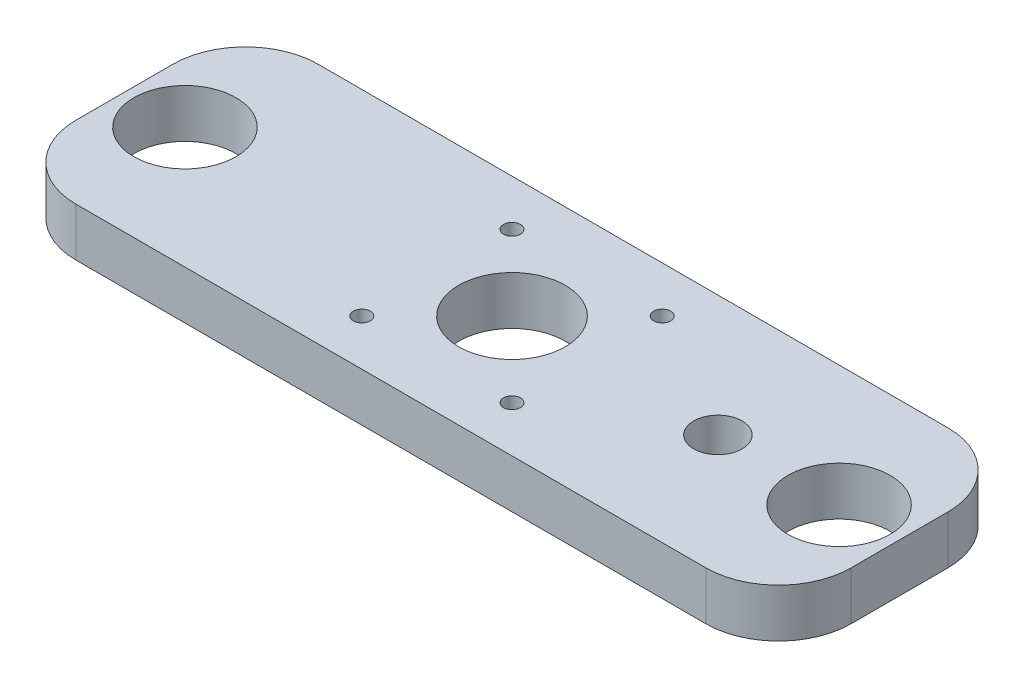
ISO-10303-21;
HEADER;
FILE_DESCRIPTION(('STEP AP214'),'2;1');
FILE_NAME('part.step','',(''),(''),'','','');
FILE_SCHEMA(('AUTOMOTIVE_DESIGN { 1 0 10303 214 1 1 1 1 }'));
ENDSEC;
DATA;
#1=APPLICATION_CONTEXT('core data for automotive mechanical design processes');
#2=APPLICATION_PROTOCOL_DEFINITION('international standard','automotive_design',2000,#1);
#3=PRODUCT_CONTEXT('',#1,'mechanical');
#4=PRODUCT('Part','Part','',(#3));
#5=PRODUCT_RELATED_PRODUCT_CATEGORY('part','',(#4));
#6=PRODUCT_DEFINITION_FORMATION('','',#4);
#7=PRODUCT_DEFINITION_CONTEXT('part definition',#1,'design');
#8=PRODUCT_DEFINITION('design','',#6,#7);
#9=PRODUCT_DEFINITION_SHAPE('','',#8);
#10=(LENGTH_UNIT() NAMED_UNIT(*) SI_UNIT(.MILLI.,.METRE.));
#11=(NAMED_UNIT(*) PLANE_ANGLE_UNIT() SI_UNIT($,.RADIAN.));
#12=(NAMED_UNIT(*) SI_UNIT($,.STERADIAN.) SOLID_ANGLE_UNIT());
#13=UNCERTAINTY_MEASURE_WITH_UNIT(LENGTH_MEASURE(1.E-05),#10,'distance_accuracy_value','');
#14=(GEOMETRIC_REPRESENTATION_CONTEXT(3) GLOBAL_UNCERTAINTY_ASSIGNED_CONTEXT((#13)) GLOBAL_UNIT_ASSIGNED_CONTEXT((#10,
#11,#12)) REPRESENTATION_CONTEXT('',''));
#15=CARTESIAN_POINT('',(0.,0.,0.));
#16=DIRECTION('',(0.,0.,1.));
#17=DIRECTION('',(1.,0.,0.));
#18=AXIS2_PLACEMENT_3D('',#15,#16,#17);
#19=CARTESIAN_POINT('',(0.,10.,0.));
#20=DIRECTION('',(0.,-1.,0.));
#21=DIRECTION('',(0.,0.,-1.));
#22=AXIS2_PLACEMENT_3D('',#19,#20,#21);
#23=PLANE('',#22);
#24=DIRECTION('',(1.,0.,0.));
#25=VECTOR('',#24,1.);
#26=CARTESIAN_POINT('',(-80.,10.,25.));
#27=LINE('',#26,#25);
#28=CARTESIAN_POINT('',(-65.,10.,25.));
#29=VERTEX_POINT('',#28);
#30=CARTESIAN_POINT('',(65.,10.,25.));
#31=VERTEX_POINT('',#30);
#32=EDGE_CURVE('E152',#29,#31,#27,.T.);
#33=ORIENTED_EDGE('',*,*,#32,.T.);
#34=CARTESIAN_POINT('',(65.,10.,10.));
#35=DIRECTION('',(0.,-1.,0.));
#36=DIRECTION('',(0.,0.,-1.));
#37=AXIS2_PLACEMENT_3D('',#34,#35,#36);
#38=CIRCLE('',#37,15.);
#39=CARTESIAN_POINT('',(80.,10.,10.));
#40=VERTEX_POINT('',#39);
#41=EDGE_CURVE('E182',#31,#40,#38,.F.);
#42=ORIENTED_EDGE('',*,*,#41,.T.);
#43=DIRECTION('',(0.,0.,-1.));
#44=VECTOR('',#43,1.);
#45=CARTESIAN_POINT('',(80.,10.,25.));
#46=LINE('',#45,#44);
#47=CARTESIAN_POINT('',(80.,10.,-10.));
#48=VERTEX_POINT('',#47);
#49=EDGE_CURVE('E131',#40,#48,#46,.T.);
#50=ORIENTED_EDGE('',*,*,#49,.T.);
#51=CARTESIAN_POINT('',(65.,10.,-10.));
#52=DIRECTION('',(0.,-1.,0.));
#53=DIRECTION('',(0.,0.,-1.));
#54=AXIS2_PLACEMENT_3D('',#51,#52,#53);
#55=CIRCLE('',#54,15.);
#56=CARTESIAN_POINT('',(65.,10.,-25.));
#57=VERTEX_POINT('',#56);
#58=EDGE_CURVE('E179',#48,#57,#55,.F.);
#59=ORIENTED_EDGE('',*,*,#58,.T.);
#60=DIRECTION('',(-1.,0.,0.));
#61=VECTOR('',#60,1.);
#62=CARTESIAN_POINT('',(-80.,10.,-25.));
#63=LINE('',#62,#61);
#64=CARTESIAN_POINT('',(-65.,10.,-25.));
#65=VERTEX_POINT('',#64);
#66=EDGE_CURVE('E197',#57,#65,#63,.T.);
#67=ORIENTED_EDGE('',*,*,#66,.T.);
#68=CARTESIAN_POINT('',(-65.,10.,-10.));
#69=DIRECTION('',(0.,-1.,0.));
#70=DIRECTION('',(0.,0.,-1.));
#71=AXIS2_PLACEMENT_3D('',#68,#69,#70);
#72=CIRCLE('',#71,15.);
#73=CARTESIAN_POINT('',(-80.,10.,-10.));
#74=VERTEX_POINT('',#73);
#75=EDGE_CURVE('E65',#65,#74,#72,.F.);
#76=ORIENTED_EDGE('',*,*,#75,.T.);
#77=DIRECTION('',(0.,0.,1.));
#78=VECTOR('',#77,1.);
#79=CARTESIAN_POINT('',(-80.,10.,25.));
#80=LINE('',#79,#78);
#81=CARTESIAN_POINT('',(-80.,10.,10.));
#82=VERTEX_POINT('',#81);
#83=EDGE_CURVE('E195',#74,#82,#80,.T.);
#84=ORIENTED_EDGE('',*,*,#83,.T.);
#85=CARTESIAN_POINT('',(-65.,10.,10.));
#86=DIRECTION('',(0.,-1.,0.));
#87=DIRECTION('',(0.,0.,-1.));
#88=AXIS2_PLACEMENT_3D('',#85,#86,#87);
#89=CIRCLE('',#88,15.);
#90=EDGE_CURVE('E174',#82,#29,#89,.F.);
#91=ORIENTED_EDGE('',*,*,#90,.T.);
#92=EDGE_LOOP('',(#33,#42,#50,#59,#67,#76,#84,#91));
#93=FACE_BOUND('',#92,.T.);
#94=CARTESIAN_POINT('',(0.,10.,0.));
#95=DIRECTION('',(0.,1.,0.));
#96=DIRECTION('',(0.,0.,1.));
#97=AXIS2_PLACEMENT_3D('',#94,#95,#96);
#98=CIRCLE('',#97,11.);
#99=CARTESIAN_POINT('',(0.,10.,11.));
#100=VERTEX_POINT('',#99);
#101=EDGE_CURVE('E141',#100,#100,#98,.T.);
#102=ORIENTED_EDGE('',*,*,#101,.F.);
#103=EDGE_LOOP('',(#102));
#104=FACE_BOUND('',#103,.T.);
#105=CARTESIAN_POINT('',(15.5,10.,-15.5));
#106=DIRECTION('',(0.,1.,0.));
#107=DIRECTION('',(0.,0.,1.));
#108=AXIS2_PLACEMENT_3D('',#105,#106,#107);
#109=CIRCLE('',#108,1.75);
#110=CARTESIAN_POINT('',(15.5,10.,-13.75));
#111=VERTEX_POINT('',#110);
#112=EDGE_CURVE('E205',#111,#111,#109,.T.);
#113=ORIENTED_EDGE('',*,*,#112,.F.);
#114=EDGE_LOOP('',(#113));
#115=FACE_BOUND('',#114,.T.);
#116=CARTESIAN_POINT('',(-15.5,10.,-15.5));
#117=DIRECTION('',(0.,1.,0.));
#118=DIRECTION('',(0.,0.,1.));
#119=AXIS2_PLACEMENT_3D('',#116,#117,#118);
#120=CIRCLE('',#119,1.75);
#121=CARTESIAN_POINT('',(-15.5,10.,-13.75));
#122=VERTEX_POINT('',#121);
#123=EDGE_CURVE('E211',#122,#122,#120,.T.);
#124=ORIENTED_EDGE('',*,*,#123,.F.);
#125=EDGE_LOOP('',(#124));
#126=FACE_BOUND('',#125,.T.);
#127=CARTESIAN_POINT('',(-15.5,10.,15.5));
#128=DIRECTION('',(0.,1.,0.));
#129=DIRECTION('',(0.,0.,1.));
#130=AXIS2_PLACEMENT_3D('',#127,#128,#129);
#131=CIRCLE('',#130,1.75);
#132=CARTESIAN_POINT('',(-15.5,10.,17.25));
#133=VERTEX_POINT('',#132);
#134=EDGE_CURVE('E219',#133,#133,#131,.T.);
#135=ORIENTED_EDGE('',*,*,#134,.F.);
#136=EDGE_LOOP('',(#135));
#137=FACE_BOUND('',#136,.T.);
#138=CARTESIAN_POINT('',(15.5,10.,15.5));
#139=DIRECTION('',(0.,1.,0.));
#140=DIRECTION('',(0.,0.,1.));
#141=AXIS2_PLACEMENT_3D('',#138,#139,#140);
#142=CIRCLE('',#141,1.75);
#143=CARTESIAN_POINT('',(15.5,10.,17.25));
#144=VERTEX_POINT('',#143);
#145=EDGE_CURVE('E227',#144,#144,#142,.T.);
#146=ORIENTED_EDGE('',*,*,#145,.F.);
#147=EDGE_LOOP('',(#146));
#148=FACE_BOUND('',#147,.T.);
#149=CARTESIAN_POINT('',(-67.5,10.,0.));
#150=DIRECTION('',(0.,1.,0.));
#151=DIRECTION('',(0.,0.,1.));
#152=AXIS2_PLACEMENT_3D('',#149,#150,#151);
#153=CIRCLE('',#152,10.55);
#154=CARTESIAN_POINT('',(-67.5,10.,10.55));
#155=VERTEX_POINT('',#154);
#156=EDGE_CURVE('E235',#155,#155,#153,.T.);
#157=ORIENTED_EDGE('',*,*,#156,.F.);
#158=EDGE_LOOP('',(#157));
#159=FACE_BOUND('',#158,.T.);
#160=CARTESIAN_POINT('',(67.5,10.,0.));
#161=DIRECTION('',(0.,1.,0.));
#162=DIRECTION('',(0.,0.,1.));
#163=AXIS2_PLACEMENT_3D('',#160,#161,#162);
#164=CIRCLE('',#163,10.55);
#165=CARTESIAN_POINT('',(67.5,10.,10.55));
#166=VERTEX_POINT('',#165);
#167=EDGE_CURVE('E243',#166,#166,#164,.T.);
#168=ORIENTED_EDGE('',*,*,#167,.F.);
#169=EDGE_LOOP('',(#168));
#170=FACE_BOUND('',#169,.T.);
#171=CARTESIAN_POINT('',(42.5,10.,0.));
#172=DIRECTION('',(0.,1.,0.));
#173=DIRECTION('',(0.,0.,1.));
#174=AXIS2_PLACEMENT_3D('',#171,#172,#173);
#175=CIRCLE('',#174,5.);
#176=CARTESIAN_POINT('',(42.5,10.,5.));
#177=VERTEX_POINT('',#176);
#178=EDGE_CURVE('E251',#177,#177,#175,.T.);
#179=ORIENTED_EDGE('',*,*,#178,.F.);
#180=EDGE_LOOP('',(#179));
#181=FACE_BOUND('',#180,.T.);
#182=ADVANCED_FACE('F43',(#93,#104,#115,#126,#137,#148,#159,#170,#181),#23,.F.);
#183=CARTESIAN_POINT('',(0.,0.,0.));
#184=DIRECTION('',(0.,-1.,0.));
#185=DIRECTION('',(0.,0.,-1.));
#186=AXIS2_PLACEMENT_3D('',#183,#184,#185);
#187=PLANE('',#186);
#188=CARTESIAN_POINT('',(67.5,0.,0.));
#189=DIRECTION('',(0.,1.,0.));
#190=DIRECTION('',(0.,0.,1.));
#191=AXIS2_PLACEMENT_3D('',#188,#189,#190);
#192=CIRCLE('',#191,10.55);
#193=CARTESIAN_POINT('',(67.5,0.,10.55));
#194=VERTEX_POINT('',#193);
#195=EDGE_CURVE('E247',#194,#194,#192,.T.);
#196=ORIENTED_EDGE('',*,*,#195,.T.);
#197=EDGE_LOOP('',(#196));
#198=FACE_BOUND('',#197,.T.);
#199=CARTESIAN_POINT('',(15.5,0.,15.5));
#200=DIRECTION('',(0.,1.,0.));
#201=DIRECTION('',(0.,0.,1.));
#202=AXIS2_PLACEMENT_3D('',#199,#200,#201);
#203=CIRCLE('',#202,1.75);
#204=CARTESIAN_POINT('',(15.5,0.,17.25));
#205=VERTEX_POINT('',#204);
#206=EDGE_CURVE('E231',#205,#205,#203,.T.);
#207=ORIENTED_EDGE('',*,*,#206,.T.);
#208=EDGE_LOOP('',(#207));
#209=FACE_BOUND('',#208,.T.);
#210=CARTESIAN_POINT('',(-15.5,0.,-15.5));
#211=DIRECTION('',(0.,1.,0.));
#212=DIRECTION('',(0.,0.,1.));
#213=AXIS2_PLACEMENT_3D('',#210,#211,#212);
#214=CIRCLE('',#213,1.75);
#215=CARTESIAN_POINT('',(-15.5,0.,-13.75));
#216=VERTEX_POINT('',#215);
#217=EDGE_CURVE('E215',#216,#216,#214,.T.);
#218=ORIENTED_EDGE('',*,*,#217,.T.);
#219=EDGE_LOOP('',(#218));
#220=FACE_BOUND('',#219,.T.);
#221=CARTESIAN_POINT('',(0.,0.,0.));
#222=DIRECTION('',(0.,1.,0.));
#223=DIRECTION('',(0.,0.,1.));
#224=AXIS2_PLACEMENT_3D('',#221,#222,#223);
#225=CIRCLE('',#224,11.);
#226=CARTESIAN_POINT('',(0.,0.,11.));
#227=VERTEX_POINT('',#226);
#228=EDGE_CURVE('E149',#227,#227,#225,.T.);
#229=ORIENTED_EDGE('',*,*,#228,.T.);
#230=EDGE_LOOP('',(#229));
#231=FACE_BOUND('',#230,.T.);
#232=DIRECTION('',(0.,0.,-1.));
#233=VECTOR('',#232,1.);
#234=CARTESIAN_POINT('',(80.,0.,25.));
#235=LINE('',#234,#233);
#236=CARTESIAN_POINT('',(80.,0.,10.));
#237=VERTEX_POINT('',#236);
#238=CARTESIAN_POINT('',(80.,0.,-10.));
#239=VERTEX_POINT('',#238);
#240=EDGE_CURVE('E128',#237,#239,#235,.T.);
#241=ORIENTED_EDGE('',*,*,#240,.F.);
#242=CARTESIAN_POINT('',(65.,0.,10.));
#243=DIRECTION('',(0.,-1.,0.));
#244=DIRECTION('',(0.,0.,-1.));
#245=AXIS2_PLACEMENT_3D('',#242,#243,#244);
#246=CIRCLE('',#245,15.);
#247=CARTESIAN_POINT('',(65.,0.,25.));
#248=VERTEX_POINT('',#247);
#249=EDGE_CURVE('E110',#237,#248,#246,.T.);
#250=ORIENTED_EDGE('',*,*,#249,.T.);
#251=DIRECTION('',(1.,0.,0.));
#252=VECTOR('',#251,1.);
#253=CARTESIAN_POINT('',(-80.,0.,25.));
#254=LINE('',#253,#252);
#255=CARTESIAN_POINT('',(-65.,0.,25.));
#256=VERTEX_POINT('',#255);
#257=EDGE_CURVE('E157',#256,#248,#254,.T.);
#258=ORIENTED_EDGE('',*,*,#257,.F.);
#259=CARTESIAN_POINT('',(-65.,0.,10.));
#260=DIRECTION('',(0.,-1.,0.));
#261=DIRECTION('',(0.,0.,-1.));
#262=AXIS2_PLACEMENT_3D('',#259,#260,#261);
#263=CIRCLE('',#262,15.);
#264=CARTESIAN_POINT('',(-80.,0.,10.));
#265=VERTEX_POINT('',#264);
#266=EDGE_CURVE('E133',#256,#265,#263,.T.);
#267=ORIENTED_EDGE('',*,*,#266,.T.);
#268=DIRECTION('',(0.,0.,1.));
#269=VECTOR('',#268,1.);
#270=CARTESIAN_POINT('',(-80.,0.,25.));
#271=LINE('',#270,#269);
#272=CARTESIAN_POINT('',(-80.,0.,-10.));
#273=VERTEX_POINT('',#272);
#274=EDGE_CURVE('E146',#273,#265,#271,.T.);
#275=ORIENTED_EDGE('',*,*,#274,.F.);
#276=CARTESIAN_POINT('',(-65.,0.,-10.));
#277=DIRECTION('',(0.,-1.,0.));
#278=DIRECTION('',(0.,0.,-1.));
#279=AXIS2_PLACEMENT_3D('',#276,#277,#278);
#280=CIRCLE('',#279,15.);
#281=CARTESIAN_POINT('',(-65.,0.,-25.));
#282=VERTEX_POINT('',#281);
#283=EDGE_CURVE('E164',#273,#282,#280,.T.);
#284=ORIENTED_EDGE('',*,*,#283,.T.);
#285=DIRECTION('',(-1.,0.,0.));
#286=VECTOR('',#285,1.);
#287=CARTESIAN_POINT('',(-80.,0.,-25.));
#288=LINE('',#287,#286);
#289=CARTESIAN_POINT('',(65.,0.,-25.));
#290=VERTEX_POINT('',#289);
#291=EDGE_CURVE('E140',#290,#282,#288,.T.);
#292=ORIENTED_EDGE('',*,*,#291,.F.);
#293=CARTESIAN_POINT('',(65.,0.,-10.));
#294=DIRECTION('',(0.,-1.,0.));
#295=DIRECTION('',(0.,0.,-1.));
#296=AXIS2_PLACEMENT_3D('',#293,#294,#295);
#297=CIRCLE('',#296,15.);
#298=EDGE_CURVE('E122',#290,#239,#297,.T.);
#299=ORIENTED_EDGE('',*,*,#298,.T.);
#300=EDGE_LOOP('',(#241,#250,#258,#267,#275,#284,#292,#299));
#301=FACE_BOUND('',#300,.T.);
#302=CARTESIAN_POINT('',(15.5,0.,-15.5));
#303=DIRECTION('',(0.,1.,0.));
#304=DIRECTION('',(0.,0.,1.));
#305=AXIS2_PLACEMENT_3D('',#302,#303,#304);
#306=CIRCLE('',#305,1.75);
#307=CARTESIAN_POINT('',(15.5,0.,-13.75));
#308=VERTEX_POINT('',#307);
#309=EDGE_CURVE('E207',#308,#308,#306,.T.);
#310=ORIENTED_EDGE('',*,*,#309,.T.);
#311=EDGE_LOOP('',(#310));
#312=FACE_BOUND('',#311,.T.);
#313=CARTESIAN_POINT('',(-15.5,0.,15.5));
#314=DIRECTION('',(0.,1.,0.));
#315=DIRECTION('',(0.,0.,1.));
#316=AXIS2_PLACEMENT_3D('',#313,#314,#315);
#317=CIRCLE('',#316,1.75);
#318=CARTESIAN_POINT('',(-15.5,0.,17.25));
#319=VERTEX_POINT('',#318);
#320=EDGE_CURVE('E223',#319,#319,#317,.T.);
#321=ORIENTED_EDGE('',*,*,#320,.T.);
#322=EDGE_LOOP('',(#321));
#323=FACE_BOUND('',#322,.T.);
#324=CARTESIAN_POINT('',(-67.5,0.,0.));
#325=DIRECTION('',(0.,1.,0.));
#326=DIRECTION('',(0.,0.,1.));
#327=AXIS2_PLACEMENT_3D('',#324,#325,#326);
#328=CIRCLE('',#327,10.55);
#329=CARTESIAN_POINT('',(-67.5,0.,10.55));
#330=VERTEX_POINT('',#329);
#331=EDGE_CURVE('E239',#330,#330,#328,.T.);
#332=ORIENTED_EDGE('',*,*,#331,.T.);
#333=EDGE_LOOP('',(#332));
#334=FACE_BOUND('',#333,.T.);
#335=CARTESIAN_POINT('',(42.5,0.,0.));
#336=DIRECTION('',(0.,1.,0.));
#337=DIRECTION('',(0.,0.,1.));
#338=AXIS2_PLACEMENT_3D('',#335,#336,#337);
#339=CIRCLE('',#338,5.);
#340=CARTESIAN_POINT('',(42.5,0.,5.));
#341=VERTEX_POINT('',#340);
#342=EDGE_CURVE('E255',#341,#341,#339,.T.);
#343=ORIENTED_EDGE('',*,*,#342,.T.);
#344=EDGE_LOOP('',(#343));
#345=FACE_BOUND('',#344,.T.);
#346=ADVANCED_FACE('F136',(#198,#209,#220,#231,#301,#312,#323,#334,#345),#187,.T.);
#347=CARTESIAN_POINT('',(80.,10.,25.));
#348=DIRECTION('',(-1.,0.,0.));
#349=DIRECTION('',(0.,0.,1.));
#350=AXIS2_PLACEMENT_3D('',#347,#348,#349);
#351=PLANE('',#350);
#352=ORIENTED_EDGE('',*,*,#49,.F.);
#353=DIRECTION('',(0.,-1.,0.));
#354=VECTOR('',#353,1.);
#355=CARTESIAN_POINT('',(80.,10.,10.));
#356=LINE('',#355,#354);
#357=EDGE_CURVE('E114',#40,#237,#356,.T.);
#358=ORIENTED_EDGE('',*,*,#357,.T.);
#359=ORIENTED_EDGE('',*,*,#240,.T.);
#360=DIRECTION('',(0.,-1.,0.));
#361=VECTOR('',#360,1.);
#362=CARTESIAN_POINT('',(80.,10.,-10.));
#363=LINE('',#362,#361);
#364=EDGE_CURVE('E134',#239,#48,#363,.F.);
#365=ORIENTED_EDGE('',*,*,#364,.T.);
#366=EDGE_LOOP('',(#352,#358,#359,#365));
#367=FACE_BOUND('',#366,.T.);
#368=ADVANCED_FACE('F127',(#367),#351,.F.);
#369=CARTESIAN_POINT('',(-80.,10.,-25.));
#370=DIRECTION('',(0.,0.,1.));
#371=DIRECTION('',(1.,0.,0.));
#372=AXIS2_PLACEMENT_3D('',#369,#370,#371);
#373=PLANE('',#372);
#374=ORIENTED_EDGE('',*,*,#66,.F.);
#375=DIRECTION('',(0.,-1.,0.));
#376=VECTOR('',#375,1.);
#377=CARTESIAN_POINT('',(65.,10.,-25.));
#378=LINE('',#377,#376);
#379=EDGE_CURVE('E188',#57,#290,#378,.T.);
#380=ORIENTED_EDGE('',*,*,#379,.T.);
#381=ORIENTED_EDGE('',*,*,#291,.T.);
#382=DIRECTION('',(0.,-1.,0.));
#383=VECTOR('',#382,1.);
#384=CARTESIAN_POINT('',(-65.,10.,-25.));
#385=LINE('',#384,#383);
#386=EDGE_CURVE('E185',#282,#65,#385,.F.);
#387=ORIENTED_EDGE('',*,*,#386,.T.);
#388=EDGE_LOOP('',(#374,#380,#381,#387));
#389=FACE_BOUND('',#388,.T.);
#390=ADVANCED_FACE('F285',(#389),#373,.F.);
#391=CARTESIAN_POINT('',(-80.,10.,25.));
#392=DIRECTION('',(1.,0.,0.));
#393=DIRECTION('',(0.,0.,-1.));
#394=AXIS2_PLACEMENT_3D('',#391,#392,#393);
#395=PLANE('',#394);
#396=ORIENTED_EDGE('',*,*,#83,.F.);
#397=DIRECTION('',(0.,-1.,0.));
#398=VECTOR('',#397,1.);
#399=CARTESIAN_POINT('',(-80.,10.,-10.));
#400=LINE('',#399,#398);
#401=EDGE_CURVE('E11',#74,#273,#400,.T.);
#402=ORIENTED_EDGE('',*,*,#401,.T.);
#403=ORIENTED_EDGE('',*,*,#274,.T.);
#404=DIRECTION('',(0.,-1.,0.));
#405=VECTOR('',#404,1.);
#406=CARTESIAN_POINT('',(-80.,10.,10.));
#407=LINE('',#406,#405);
#408=EDGE_CURVE('E52',#265,#82,#407,.F.);
#409=ORIENTED_EDGE('',*,*,#408,.T.);
#410=EDGE_LOOP('',(#396,#402,#403,#409));
#411=FACE_BOUND('',#410,.T.);
#412=ADVANCED_FACE('F281',(#411),#395,.F.);
#413=CARTESIAN_POINT('',(-80.,10.,25.));
#414=DIRECTION('',(0.,0.,-1.));
#415=DIRECTION('',(-1.,0.,0.));
#416=AXIS2_PLACEMENT_3D('',#413,#414,#415);
#417=PLANE('',#416);
#418=ORIENTED_EDGE('',*,*,#257,.T.);
#419=DIRECTION('',(0.,-1.,0.));
#420=VECTOR('',#419,1.);
#421=CARTESIAN_POINT('',(65.,10.,25.));
#422=LINE('',#421,#420);
#423=EDGE_CURVE('E115',#248,#31,#422,.F.);
#424=ORIENTED_EDGE('',*,*,#423,.T.);
#425=ORIENTED_EDGE('',*,*,#32,.F.);
#426=DIRECTION('',(0.,-1.,0.));
#427=VECTOR('',#426,1.);
#428=CARTESIAN_POINT('',(-65.,10.,25.));
#429=LINE('',#428,#427);
#430=EDGE_CURVE('E121',#29,#256,#429,.T.);
#431=ORIENTED_EDGE('',*,*,#430,.T.);
#432=EDGE_LOOP('',(#418,#424,#425,#431));
#433=FACE_BOUND('',#432,.T.);
#434=ADVANCED_FACE('F278',(#433),#417,.F.);
#435=CARTESIAN_POINT('',(0.,10.,0.));
#436=DIRECTION('',(0.,-1.,0.));
#437=DIRECTION('',(0.,0.,-1.));
#438=AXIS2_PLACEMENT_3D('',#435,#436,#437);
#439=CYLINDRICAL_SURFACE('',#438,11.);
#440=ORIENTED_EDGE('',*,*,#101,.T.);
#441=EDGE_LOOP('',(#440));
#442=FACE_BOUND('',#441,.T.);
#443=ORIENTED_EDGE('',*,*,#228,.F.);
#444=EDGE_LOOP('',(#443));
#445=FACE_BOUND('',#444,.T.);
#446=ADVANCED_FACE('F275',(#442,#445),#439,.F.);
#447=CARTESIAN_POINT('',(15.5,10.,-15.5));
#448=DIRECTION('',(0.,-1.,0.));
#449=DIRECTION('',(0.,0.,-1.));
#450=AXIS2_PLACEMENT_3D('',#447,#448,#449);
#451=CYLINDRICAL_SURFACE('',#450,1.75);
#452=ORIENTED_EDGE('',*,*,#112,.T.);
#453=EDGE_LOOP('',(#452));
#454=FACE_BOUND('',#453,.T.);
#455=ORIENTED_EDGE('',*,*,#309,.F.);
#456=EDGE_LOOP('',(#455));
#457=FACE_BOUND('',#456,.T.);
#458=ADVANCED_FACE('F438',(#454,#457),#451,.F.);
#459=CARTESIAN_POINT('',(-15.5,10.,-15.5));
#460=DIRECTION('',(0.,-1.,0.));
#461=DIRECTION('',(0.,0.,-1.));
#462=AXIS2_PLACEMENT_3D('',#459,#460,#461);
#463=CYLINDRICAL_SURFACE('',#462,1.75);
#464=ORIENTED_EDGE('',*,*,#123,.T.);
#465=EDGE_LOOP('',(#464));
#466=FACE_BOUND('',#465,.T.);
#467=ORIENTED_EDGE('',*,*,#217,.F.);
#468=EDGE_LOOP('',(#467));
#469=FACE_BOUND('',#468,.T.);
#470=ADVANCED_FACE('F427',(#466,#469),#463,.F.);
#471=CARTESIAN_POINT('',(-15.5,10.,15.5));
#472=DIRECTION('',(0.,-1.,0.));
#473=DIRECTION('',(0.,0.,-1.));
#474=AXIS2_PLACEMENT_3D('',#471,#472,#473);
#475=CYLINDRICAL_SURFACE('',#474,1.75);
#476=ORIENTED_EDGE('',*,*,#134,.T.);
#477=EDGE_LOOP('',(#476));
#478=FACE_BOUND('',#477,.T.);
#479=ORIENTED_EDGE('',*,*,#320,.F.);
#480=EDGE_LOOP('',(#479));
#481=FACE_BOUND('',#480,.T.);
#482=ADVANCED_FACE('F416',(#478,#481),#475,.F.);
#483=CARTESIAN_POINT('',(15.5,10.,15.5));
#484=DIRECTION('',(0.,-1.,0.));
#485=DIRECTION('',(0.,0.,-1.));
#486=AXIS2_PLACEMENT_3D('',#483,#484,#485);
#487=CYLINDRICAL_SURFACE('',#486,1.75);
#488=ORIENTED_EDGE('',*,*,#145,.T.);
#489=EDGE_LOOP('',(#488));
#490=FACE_BOUND('',#489,.T.);
#491=ORIENTED_EDGE('',*,*,#206,.F.);
#492=EDGE_LOOP('',(#491));
#493=FACE_BOUND('',#492,.T.);
#494=ADVANCED_FACE('F405',(#490,#493),#487,.F.);
#495=CARTESIAN_POINT('',(-67.5,10.,0.));
#496=DIRECTION('',(0.,-1.,0.));
#497=DIRECTION('',(0.,0.,-1.));
#498=AXIS2_PLACEMENT_3D('',#495,#496,#497);
#499=CYLINDRICAL_SURFACE('',#498,10.55);
#500=ORIENTED_EDGE('',*,*,#156,.T.);
#501=EDGE_LOOP('',(#500));
#502=FACE_BOUND('',#501,.T.);
#503=ORIENTED_EDGE('',*,*,#331,.F.);
#504=EDGE_LOOP('',(#503));
#505=FACE_BOUND('',#504,.T.);
#506=ADVANCED_FACE('F394',(#502,#505),#499,.F.);
#507=CARTESIAN_POINT('',(67.5,10.,0.));
#508=DIRECTION('',(0.,-1.,0.));
#509=DIRECTION('',(0.,0.,-1.));
#510=AXIS2_PLACEMENT_3D('',#507,#508,#509);
#511=CYLINDRICAL_SURFACE('',#510,10.55);
#512=ORIENTED_EDGE('',*,*,#167,.T.);
#513=EDGE_LOOP('',(#512));
#514=FACE_BOUND('',#513,.T.);
#515=ORIENTED_EDGE('',*,*,#195,.F.);
#516=EDGE_LOOP('',(#515));
#517=FACE_BOUND('',#516,.T.);
#518=ADVANCED_FACE('F384',(#514,#517),#511,.F.);
#519=CARTESIAN_POINT('',(42.5,10.,0.));
#520=DIRECTION('',(0.,-1.,0.));
#521=DIRECTION('',(0.,0.,-1.));
#522=AXIS2_PLACEMENT_3D('',#519,#520,#521);
#523=CYLINDRICAL_SURFACE('',#522,5.);
#524=ORIENTED_EDGE('',*,*,#178,.T.);
#525=EDGE_LOOP('',(#524));
#526=FACE_BOUND('',#525,.T.);
#527=ORIENTED_EDGE('',*,*,#342,.F.);
#528=EDGE_LOOP('',(#527));
#529=FACE_BOUND('',#528,.T.);
#530=ADVANCED_FACE('F263',(#526,#529),#523,.F.);
#531=CARTESIAN_POINT('',(65.,10.,10.));
#532=DIRECTION('',(0.,-1.,0.));
#533=DIRECTION('',(0.,0.,-1.));
#534=AXIS2_PLACEMENT_3D('',#531,#532,#533);
#535=CYLINDRICAL_SURFACE('',#534,15.);
#536=ORIENTED_EDGE('',*,*,#41,.F.);
#537=ORIENTED_EDGE('',*,*,#423,.F.);
#538=ORIENTED_EDGE('',*,*,#249,.F.);
#539=ORIENTED_EDGE('',*,*,#357,.F.);
#540=EDGE_LOOP('',(#536,#537,#538,#539));
#541=FACE_BOUND('',#540,.T.);
#542=ADVANCED_FACE('F113',(#541),#535,.T.);
#543=CARTESIAN_POINT('',(65.,10.,-10.));
#544=DIRECTION('',(0.,-1.,0.));
#545=DIRECTION('',(0.,0.,-1.));
#546=AXIS2_PLACEMENT_3D('',#543,#544,#545);
#547=CYLINDRICAL_SURFACE('',#546,15.);
#548=ORIENTED_EDGE('',*,*,#58,.F.);
#549=ORIENTED_EDGE('',*,*,#364,.F.);
#550=ORIENTED_EDGE('',*,*,#298,.F.);
#551=ORIENTED_EDGE('',*,*,#379,.F.);
#552=EDGE_LOOP('',(#548,#549,#550,#551));
#553=FACE_BOUND('',#552,.T.);
#554=ADVANCED_FACE('F293',(#553),#547,.T.);
#555=CARTESIAN_POINT('',(-65.,10.,-10.));
#556=DIRECTION('',(0.,-1.,0.));
#557=DIRECTION('',(0.,0.,-1.));
#558=AXIS2_PLACEMENT_3D('',#555,#556,#557);
#559=CYLINDRICAL_SURFACE('',#558,15.);
#560=ORIENTED_EDGE('',*,*,#75,.F.);
#561=ORIENTED_EDGE('',*,*,#386,.F.);
#562=ORIENTED_EDGE('',*,*,#283,.F.);
#563=ORIENTED_EDGE('',*,*,#401,.F.);
#564=EDGE_LOOP('',(#560,#561,#562,#563));
#565=FACE_BOUND('',#564,.T.);
#566=ADVANCED_FACE('F295',(#565),#559,.T.);
#567=CARTESIAN_POINT('',(-65.,10.,10.));
#568=DIRECTION('',(0.,-1.,0.));
#569=DIRECTION('',(0.,0.,-1.));
#570=AXIS2_PLACEMENT_3D('',#567,#568,#569);
#571=CYLINDRICAL_SURFACE('',#570,15.);
#572=ORIENTED_EDGE('',*,*,#90,.F.);
#573=ORIENTED_EDGE('',*,*,#408,.F.);
#574=ORIENTED_EDGE('',*,*,#266,.F.);
#575=ORIENTED_EDGE('',*,*,#430,.F.);
#576=EDGE_LOOP('',(#572,#573,#574,#575));
#577=FACE_BOUND('',#576,.T.);
#578=ADVANCED_FACE('F45',(#577),#571,.T.);
#579=CLOSED_SHELL('',(#182,#346,#368,#390,#412,#434,#446,#458,#470,#482,#494,#506,#518,#530,
#542,#554,#566,#578));
#580=MANIFOLD_SOLID_BREP('B2',#579);
#581=ADVANCED_BREP_SHAPE_REPRESENTATION('',(#18,#580),#14);
#582=SHAPE_DEFINITION_REPRESENTATION(#9,#581);
ENDSEC;
END-ISO-10303-21;
